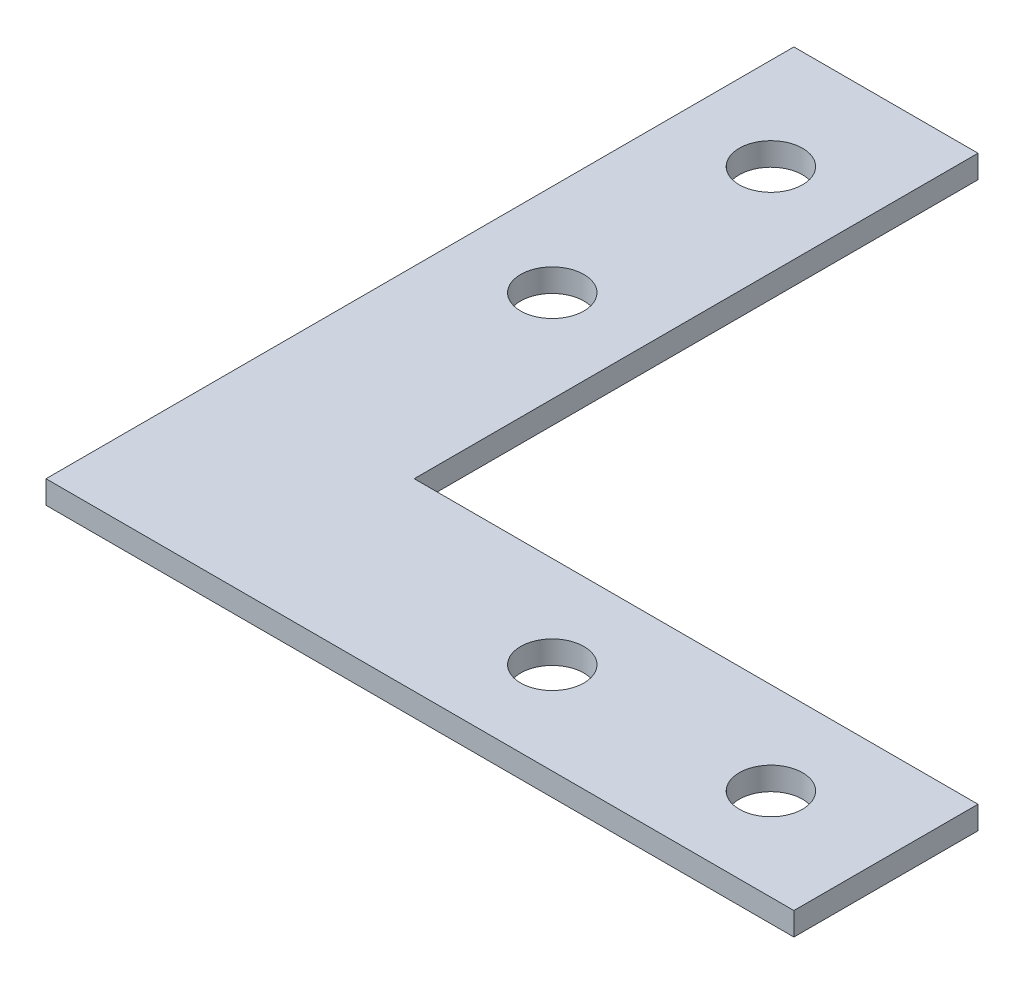
ISO-10303-21;
HEADER;
FILE_DESCRIPTION(('STEP AP214'),'2;1');
FILE_NAME('part.step','',(''),(''),'','','');
FILE_SCHEMA(('AUTOMOTIVE_DESIGN { 1 0 10303 214 1 1 1 1 }'));
ENDSEC;
DATA;
#1=APPLICATION_CONTEXT('core data for automotive mechanical design processes');
#2=APPLICATION_PROTOCOL_DEFINITION('international standard','automotive_design',2000,#1);
#3=PRODUCT_CONTEXT('',#1,'mechanical');
#4=PRODUCT('Part','Part','',(#3));
#5=PRODUCT_RELATED_PRODUCT_CATEGORY('part','',(#4));
#6=PRODUCT_DEFINITION_FORMATION('','',#4);
#7=PRODUCT_DEFINITION_CONTEXT('part definition',#1,'design');
#8=PRODUCT_DEFINITION('design','',#6,#7);
#9=PRODUCT_DEFINITION_SHAPE('','',#8);
#10=(LENGTH_UNIT() NAMED_UNIT(*) SI_UNIT(.MILLI.,.METRE.));
#11=(NAMED_UNIT(*) PLANE_ANGLE_UNIT() SI_UNIT($,.RADIAN.));
#12=(NAMED_UNIT(*) SI_UNIT($,.STERADIAN.) SOLID_ANGLE_UNIT());
#13=UNCERTAINTY_MEASURE_WITH_UNIT(LENGTH_MEASURE(1.E-05),#10,'distance_accuracy_value','');
#14=(GEOMETRIC_REPRESENTATION_CONTEXT(3) GLOBAL_UNCERTAINTY_ASSIGNED_CONTEXT((#13)) GLOBAL_UNIT_ASSIGNED_CONTEXT((#10,
#11,#12)) REPRESENTATION_CONTEXT('',''));
#15=CARTESIAN_POINT('',(0.,0.,0.));
#16=DIRECTION('',(0.,0.,1.));
#17=DIRECTION('',(1.,0.,0.));
#18=AXIS2_PLACEMENT_3D('',#15,#16,#17);
#19=CARTESIAN_POINT('',(0.,2.,0.));
#20=DIRECTION('',(0.,-1.,0.));
#21=DIRECTION('',(0.,0.,-1.));
#22=AXIS2_PLACEMENT_3D('',#19,#20,#21);
#23=PLANE('',#22);
#24=DIRECTION('',(1.,0.,0.));
#25=VECTOR('',#24,1.);
#26=CARTESIAN_POINT('',(65.,2.,0.));
#27=LINE('',#26,#25);
#28=CARTESIAN_POINT('',(0.,2.,0.));
#29=VERTEX_POINT('',#28);
#30=CARTESIAN_POINT('',(65.,2.,0.));
#31=VERTEX_POINT('',#30);
#32=EDGE_CURVE('E146',#29,#31,#27,.T.);
#33=ORIENTED_EDGE('',*,*,#32,.T.);
#34=DIRECTION('',(0.,0.,-1.));
#35=VECTOR('',#34,1.);
#36=CARTESIAN_POINT('',(65.,2.,-16.));
#37=LINE('',#36,#35);
#38=CARTESIAN_POINT('',(65.,2.,-16.));
#39=VERTEX_POINT('',#38);
#40=EDGE_CURVE('E94',#31,#39,#37,.T.);
#41=ORIENTED_EDGE('',*,*,#40,.T.);
#42=DIRECTION('',(-1.,0.,0.));
#43=VECTOR('',#42,1.);
#44=CARTESIAN_POINT('',(16.,2.,-16.));
#45=LINE('',#44,#43);
#46=CARTESIAN_POINT('',(16.,2.,-16.));
#47=VERTEX_POINT('',#46);
#48=EDGE_CURVE('E107',#39,#47,#45,.T.);
#49=ORIENTED_EDGE('',*,*,#48,.T.);
#50=DIRECTION('',(0.,0.,-1.));
#51=VECTOR('',#50,1.);
#52=CARTESIAN_POINT('',(16.,2.,-65.));
#53=LINE('',#52,#51);
#54=CARTESIAN_POINT('',(16.,2.,-65.));
#55=VERTEX_POINT('',#54);
#56=EDGE_CURVE('E101',#47,#55,#53,.T.);
#57=ORIENTED_EDGE('',*,*,#56,.T.);
#58=DIRECTION('',(-1.,0.,0.));
#59=VECTOR('',#58,1.);
#60=CARTESIAN_POINT('',(0.,2.,-65.));
#61=LINE('',#60,#59);
#62=CARTESIAN_POINT('',(0.,2.,-65.));
#63=VERTEX_POINT('',#62);
#64=EDGE_CURVE('E105',#55,#63,#61,.T.);
#65=ORIENTED_EDGE('',*,*,#64,.T.);
#66=DIRECTION('',(0.,0.,1.));
#67=VECTOR('',#66,1.);
#68=CARTESIAN_POINT('',(0.,2.,0.));
#69=LINE('',#68,#67);
#70=EDGE_CURVE('E57',#63,#29,#69,.T.);
#71=ORIENTED_EDGE('',*,*,#70,.T.);
#72=EDGE_LOOP('',(#33,#41,#49,#57,#65,#71));
#73=FACE_BOUND('',#72,.T.);
#74=CARTESIAN_POINT('',(8.,2.,-55.));
#75=DIRECTION('',(0.,1.,0.));
#76=DIRECTION('',(0.,0.,1.));
#77=AXIS2_PLACEMENT_3D('',#74,#75,#76);
#78=CIRCLE('',#77,2.75);
#79=CARTESIAN_POINT('',(8.,2.,-52.25));
#80=VERTEX_POINT('',#79);
#81=EDGE_CURVE('E134',#80,#80,#78,.T.);
#82=ORIENTED_EDGE('',*,*,#81,.F.);
#83=EDGE_LOOP('',(#82));
#84=FACE_BOUND('',#83,.T.);
#85=CARTESIAN_POINT('',(8.,2.,-36.));
#86=DIRECTION('',(0.,1.,0.));
#87=DIRECTION('',(0.,0.,1.));
#88=AXIS2_PLACEMENT_3D('',#85,#86,#87);
#89=CIRCLE('',#88,2.75);
#90=CARTESIAN_POINT('',(8.,2.,-33.25));
#91=VERTEX_POINT('',#90);
#92=EDGE_CURVE('E218',#91,#91,#89,.T.);
#93=ORIENTED_EDGE('',*,*,#92,.F.);
#94=EDGE_LOOP('',(#93));
#95=FACE_BOUND('',#94,.T.);
#96=CARTESIAN_POINT('',(55.0000000000028,2.,-8.0000000000026));
#97=DIRECTION('',(0.,1.,0.));
#98=DIRECTION('',(0.,0.,1.));
#99=AXIS2_PLACEMENT_3D('',#96,#97,#98);
#100=CIRCLE('',#99,2.75);
#101=CARTESIAN_POINT('',(55.0000000000028,2.,-5.25000000000261));
#102=VERTEX_POINT('',#101);
#103=EDGE_CURVE('E210',#102,#102,#100,.T.);
#104=ORIENTED_EDGE('',*,*,#103,.F.);
#105=EDGE_LOOP('',(#104));
#106=FACE_BOUND('',#105,.T.);
#107=CARTESIAN_POINT('',(36.0000000000028,2.,-8.00000000000267));
#108=DIRECTION('',(0.,1.,0.));
#109=DIRECTION('',(0.,0.,1.));
#110=AXIS2_PLACEMENT_3D('',#107,#108,#109);
#111=CIRCLE('',#110,2.75);
#112=CARTESIAN_POINT('',(36.0000000000028,2.,-5.25000000000267));
#113=VERTEX_POINT('',#112);
#114=EDGE_CURVE('E199',#113,#113,#111,.T.);
#115=ORIENTED_EDGE('',*,*,#114,.F.);
#116=EDGE_LOOP('',(#115));
#117=FACE_BOUND('',#116,.T.);
#118=ADVANCED_FACE('F39',(#73,#84,#95,#106,#117),#23,.F.);
#119=CARTESIAN_POINT('',(0.,0.,0.));
#120=DIRECTION('',(0.,-1.,0.));
#121=DIRECTION('',(0.,0.,-1.));
#122=AXIS2_PLACEMENT_3D('',#119,#120,#121);
#123=PLANE('',#122);
#124=CARTESIAN_POINT('',(55.0000000000028,0.,-8.0000000000026));
#125=DIRECTION('',(0.,1.,0.));
#126=DIRECTION('',(0.,0.,1.));
#127=AXIS2_PLACEMENT_3D('',#124,#125,#126);
#128=CIRCLE('',#127,2.75);
#129=CARTESIAN_POINT('',(55.0000000000028,0.,-5.25000000000261));
#130=VERTEX_POINT('',#129);
#131=EDGE_CURVE('E207',#130,#130,#128,.T.);
#132=ORIENTED_EDGE('',*,*,#131,.T.);
#133=EDGE_LOOP('',(#132));
#134=FACE_BOUND('',#133,.T.);
#135=CARTESIAN_POINT('',(8.,0.,-55.));
#136=DIRECTION('',(0.,1.,0.));
#137=DIRECTION('',(0.,0.,1.));
#138=AXIS2_PLACEMENT_3D('',#135,#136,#137);
#139=CIRCLE('',#138,2.75);
#140=CARTESIAN_POINT('',(8.,0.,-52.25));
#141=VERTEX_POINT('',#140);
#142=EDGE_CURVE('E222',#141,#141,#139,.T.);
#143=ORIENTED_EDGE('',*,*,#142,.T.);
#144=EDGE_LOOP('',(#143));
#145=FACE_BOUND('',#144,.T.);
#146=DIRECTION('',(1.,0.,0.));
#147=VECTOR('',#146,1.);
#148=CARTESIAN_POINT('',(65.,0.,0.));
#149=LINE('',#148,#147);
#150=CARTESIAN_POINT('',(0.,0.,0.));
#151=VERTEX_POINT('',#150);
#152=CARTESIAN_POINT('',(65.,0.,0.));
#153=VERTEX_POINT('',#152);
#154=EDGE_CURVE('E129',#151,#153,#149,.T.);
#155=ORIENTED_EDGE('',*,*,#154,.F.);
#156=DIRECTION('',(0.,0.,1.));
#157=VECTOR('',#156,1.);
#158=CARTESIAN_POINT('',(0.,0.,0.));
#159=LINE('',#158,#157);
#160=CARTESIAN_POINT('',(0.,0.,-65.));
#161=VERTEX_POINT('',#160);
#162=EDGE_CURVE('E86',#161,#151,#159,.T.);
#163=ORIENTED_EDGE('',*,*,#162,.F.);
#164=DIRECTION('',(-1.,0.,0.));
#165=VECTOR('',#164,1.);
#166=CARTESIAN_POINT('',(0.,0.,-65.));
#167=LINE('',#166,#165);
#168=CARTESIAN_POINT('',(16.,0.,-65.));
#169=VERTEX_POINT('',#168);
#170=EDGE_CURVE('E80',#169,#161,#167,.T.);
#171=ORIENTED_EDGE('',*,*,#170,.F.);
#172=DIRECTION('',(0.,0.,-1.));
#173=VECTOR('',#172,1.);
#174=CARTESIAN_POINT('',(16.,0.,-65.));
#175=LINE('',#174,#173);
#176=CARTESIAN_POINT('',(16.,0.,-16.));
#177=VERTEX_POINT('',#176);
#178=EDGE_CURVE('E116',#177,#169,#175,.T.);
#179=ORIENTED_EDGE('',*,*,#178,.F.);
#180=DIRECTION('',(-1.,0.,0.));
#181=VECTOR('',#180,1.);
#182=CARTESIAN_POINT('',(16.,0.,-16.));
#183=LINE('',#182,#181);
#184=CARTESIAN_POINT('',(65.,0.,-16.));
#185=VERTEX_POINT('',#184);
#186=EDGE_CURVE('E137',#185,#177,#183,.T.);
#187=ORIENTED_EDGE('',*,*,#186,.F.);
#188=DIRECTION('',(0.,0.,-1.));
#189=VECTOR('',#188,1.);
#190=CARTESIAN_POINT('',(65.,0.,-16.));
#191=LINE('',#190,#189);
#192=EDGE_CURVE('E133',#153,#185,#191,.T.);
#193=ORIENTED_EDGE('',*,*,#192,.F.);
#194=EDGE_LOOP('',(#155,#163,#171,#179,#187,#193));
#195=FACE_BOUND('',#194,.T.);
#196=CARTESIAN_POINT('',(8.,0.,-36.));
#197=DIRECTION('',(0.,1.,0.));
#198=DIRECTION('',(0.,0.,1.));
#199=AXIS2_PLACEMENT_3D('',#196,#197,#198);
#200=CIRCLE('',#199,2.75);
#201=CARTESIAN_POINT('',(8.,0.,-33.25));
#202=VERTEX_POINT('',#201);
#203=EDGE_CURVE('E214',#202,#202,#200,.T.);
#204=ORIENTED_EDGE('',*,*,#203,.T.);
#205=EDGE_LOOP('',(#204));
#206=FACE_BOUND('',#205,.T.);
#207=CARTESIAN_POINT('',(36.0000000000028,0.,-8.00000000000267));
#208=DIRECTION('',(0.,1.,0.));
#209=DIRECTION('',(0.,0.,1.));
#210=AXIS2_PLACEMENT_3D('',#207,#208,#209);
#211=CIRCLE('',#210,2.75);
#212=CARTESIAN_POINT('',(36.0000000000028,0.,-5.25000000000267));
#213=VERTEX_POINT('',#212);
#214=EDGE_CURVE('E202',#213,#213,#211,.T.);
#215=ORIENTED_EDGE('',*,*,#214,.T.);
#216=EDGE_LOOP('',(#215));
#217=FACE_BOUND('',#216,.T.);
#218=ADVANCED_FACE('F159',(#134,#145,#195,#206,#217),#123,.T.);
#219=CARTESIAN_POINT('',(65.,2.,0.));
#220=DIRECTION('',(0.,0.,-1.));
#221=DIRECTION('',(-1.,0.,0.));
#222=AXIS2_PLACEMENT_3D('',#219,#220,#221);
#223=PLANE('',#222);
#224=ORIENTED_EDGE('',*,*,#154,.T.);
#225=DIRECTION('',(0.,-1.,0.));
#226=VECTOR('',#225,1.);
#227=CARTESIAN_POINT('',(65.,2.,0.));
#228=LINE('',#227,#226);
#229=EDGE_CURVE('E11',#31,#153,#228,.T.);
#230=ORIENTED_EDGE('',*,*,#229,.F.);
#231=ORIENTED_EDGE('',*,*,#32,.F.);
#232=DIRECTION('',(0.,-1.,0.));
#233=VECTOR('',#232,1.);
#234=CARTESIAN_POINT('',(0.,2.,0.));
#235=LINE('',#234,#233);
#236=EDGE_CURVE('E125',#29,#151,#235,.T.);
#237=ORIENTED_EDGE('',*,*,#236,.T.);
#238=EDGE_LOOP('',(#224,#230,#231,#237));
#239=FACE_BOUND('',#238,.T.);
#240=ADVANCED_FACE('F41',(#239),#223,.F.);
#241=CARTESIAN_POINT('',(65.,2.,-16.));
#242=DIRECTION('',(-1.,0.,0.));
#243=DIRECTION('',(0.,0.,1.));
#244=AXIS2_PLACEMENT_3D('',#241,#242,#243);
#245=PLANE('',#244);
#246=ORIENTED_EDGE('',*,*,#192,.T.);
#247=DIRECTION('',(0.,-1.,0.));
#248=VECTOR('',#247,1.);
#249=CARTESIAN_POINT('',(65.,2.,-16.));
#250=LINE('',#249,#248);
#251=EDGE_CURVE('E49',#39,#185,#250,.T.);
#252=ORIENTED_EDGE('',*,*,#251,.F.);
#253=ORIENTED_EDGE('',*,*,#40,.F.);
#254=ORIENTED_EDGE('',*,*,#229,.T.);
#255=EDGE_LOOP('',(#246,#252,#253,#254));
#256=FACE_BOUND('',#255,.T.);
#257=ADVANCED_FACE('F288',(#256),#245,.F.);
#258=CARTESIAN_POINT('',(16.,2.,-16.));
#259=DIRECTION('',(0.,0.,1.));
#260=DIRECTION('',(1.,0.,0.));
#261=AXIS2_PLACEMENT_3D('',#258,#259,#260);
#262=PLANE('',#261);
#263=ORIENTED_EDGE('',*,*,#186,.T.);
#264=DIRECTION('',(0.,-1.,0.));
#265=VECTOR('',#264,1.);
#266=CARTESIAN_POINT('',(16.,2.,-16.));
#267=LINE('',#266,#265);
#268=EDGE_CURVE('E118',#47,#177,#267,.T.);
#269=ORIENTED_EDGE('',*,*,#268,.F.);
#270=ORIENTED_EDGE('',*,*,#48,.F.);
#271=ORIENTED_EDGE('',*,*,#251,.T.);
#272=EDGE_LOOP('',(#263,#269,#270,#271));
#273=FACE_BOUND('',#272,.T.);
#274=ADVANCED_FACE('F156',(#273),#262,.F.);
#275=CARTESIAN_POINT('',(16.,2.,-65.));
#276=DIRECTION('',(-1.,0.,0.));
#277=DIRECTION('',(0.,0.,1.));
#278=AXIS2_PLACEMENT_3D('',#275,#276,#277);
#279=PLANE('',#278);
#280=ORIENTED_EDGE('',*,*,#178,.T.);
#281=DIRECTION('',(0.,-1.,0.));
#282=VECTOR('',#281,1.);
#283=CARTESIAN_POINT('',(16.,2.,-65.));
#284=LINE('',#283,#282);
#285=EDGE_CURVE('E113',#55,#169,#284,.T.);
#286=ORIENTED_EDGE('',*,*,#285,.F.);
#287=ORIENTED_EDGE('',*,*,#56,.F.);
#288=ORIENTED_EDGE('',*,*,#268,.T.);
#289=EDGE_LOOP('',(#280,#286,#287,#288));
#290=FACE_BOUND('',#289,.T.);
#291=ADVANCED_FACE('F114',(#290),#279,.F.);
#292=CARTESIAN_POINT('',(0.,2.,-65.));
#293=DIRECTION('',(0.,0.,1.));
#294=DIRECTION('',(1.,0.,0.));
#295=AXIS2_PLACEMENT_3D('',#292,#293,#294);
#296=PLANE('',#295);
#297=ORIENTED_EDGE('',*,*,#170,.T.);
#298=DIRECTION('',(0.,-1.,0.));
#299=VECTOR('',#298,1.);
#300=CARTESIAN_POINT('',(0.,2.,-65.));
#301=LINE('',#300,#299);
#302=EDGE_CURVE('E119',#63,#161,#301,.T.);
#303=ORIENTED_EDGE('',*,*,#302,.F.);
#304=ORIENTED_EDGE('',*,*,#64,.F.);
#305=ORIENTED_EDGE('',*,*,#285,.T.);
#306=EDGE_LOOP('',(#297,#303,#304,#305));
#307=FACE_BOUND('',#306,.T.);
#308=ADVANCED_FACE('F121',(#307),#296,.F.);
#309=CARTESIAN_POINT('',(0.,2.,0.));
#310=DIRECTION('',(1.,0.,0.));
#311=DIRECTION('',(0.,0.,-1.));
#312=AXIS2_PLACEMENT_3D('',#309,#310,#311);
#313=PLANE('',#312);
#314=ORIENTED_EDGE('',*,*,#162,.T.);
#315=ORIENTED_EDGE('',*,*,#236,.F.);
#316=ORIENTED_EDGE('',*,*,#70,.F.);
#317=ORIENTED_EDGE('',*,*,#302,.T.);
#318=EDGE_LOOP('',(#314,#315,#316,#317));
#319=FACE_BOUND('',#318,.T.);
#320=ADVANCED_FACE('F164',(#319),#313,.F.);
#321=CARTESIAN_POINT('',(8.,2.,-55.));
#322=DIRECTION('',(0.,-1.,0.));
#323=DIRECTION('',(0.,0.,-1.));
#324=AXIS2_PLACEMENT_3D('',#321,#322,#323);
#325=CYLINDRICAL_SURFACE('',#324,2.75);
#326=ORIENTED_EDGE('',*,*,#81,.T.);
#327=EDGE_LOOP('',(#326));
#328=FACE_BOUND('',#327,.T.);
#329=ORIENTED_EDGE('',*,*,#142,.F.);
#330=EDGE_LOOP('',(#329));
#331=FACE_BOUND('',#330,.T.);
#332=ADVANCED_FACE('F166',(#328,#331),#325,.F.);
#333=CARTESIAN_POINT('',(8.,2.,-36.));
#334=DIRECTION('',(0.,-1.,0.));
#335=DIRECTION('',(0.,0.,-1.));
#336=AXIS2_PLACEMENT_3D('',#333,#334,#335);
#337=CYLINDRICAL_SURFACE('',#336,2.75);
#338=ORIENTED_EDGE('',*,*,#92,.T.);
#339=EDGE_LOOP('',(#338));
#340=FACE_BOUND('',#339,.T.);
#341=ORIENTED_EDGE('',*,*,#203,.F.);
#342=EDGE_LOOP('',(#341));
#343=FACE_BOUND('',#342,.T.);
#344=ADVANCED_FACE('F172',(#340,#343),#337,.F.);
#345=CARTESIAN_POINT('',(55.0000000000028,2.,-8.0000000000026));
#346=DIRECTION('',(0.,-1.,0.));
#347=DIRECTION('',(0.,0.,-1.));
#348=AXIS2_PLACEMENT_3D('',#345,#346,#347);
#349=CYLINDRICAL_SURFACE('',#348,2.75);
#350=ORIENTED_EDGE('',*,*,#103,.T.);
#351=EDGE_LOOP('',(#350));
#352=FACE_BOUND('',#351,.T.);
#353=ORIENTED_EDGE('',*,*,#131,.F.);
#354=EDGE_LOOP('',(#353));
#355=FACE_BOUND('',#354,.T.);
#356=ADVANCED_FACE('F186',(#352,#355),#349,.F.);
#357=CARTESIAN_POINT('',(36.0000000000028,2.,-8.00000000000267));
#358=DIRECTION('',(0.,-1.,0.));
#359=DIRECTION('',(0.,0.,-1.));
#360=AXIS2_PLACEMENT_3D('',#357,#358,#359);
#361=CYLINDRICAL_SURFACE('',#360,2.75);
#362=ORIENTED_EDGE('',*,*,#114,.T.);
#363=EDGE_LOOP('',(#362));
#364=FACE_BOUND('',#363,.T.);
#365=ORIENTED_EDGE('',*,*,#214,.F.);
#366=EDGE_LOOP('',(#365));
#367=FACE_BOUND('',#366,.T.);
#368=ADVANCED_FACE('F190',(#364,#367),#361,.F.);
#369=CLOSED_SHELL('',(#118,#218,#240,#257,#274,#291,#308,#320,#332,#344,#356,#368));
#370=MANIFOLD_SOLID_BREP('B2',#369);
#371=ADVANCED_BREP_SHAPE_REPRESENTATION('',(#18,#370),#14);
#372=SHAPE_DEFINITION_REPRESENTATION(#9,#371);
ENDSEC;
END-ISO-10303-21;
